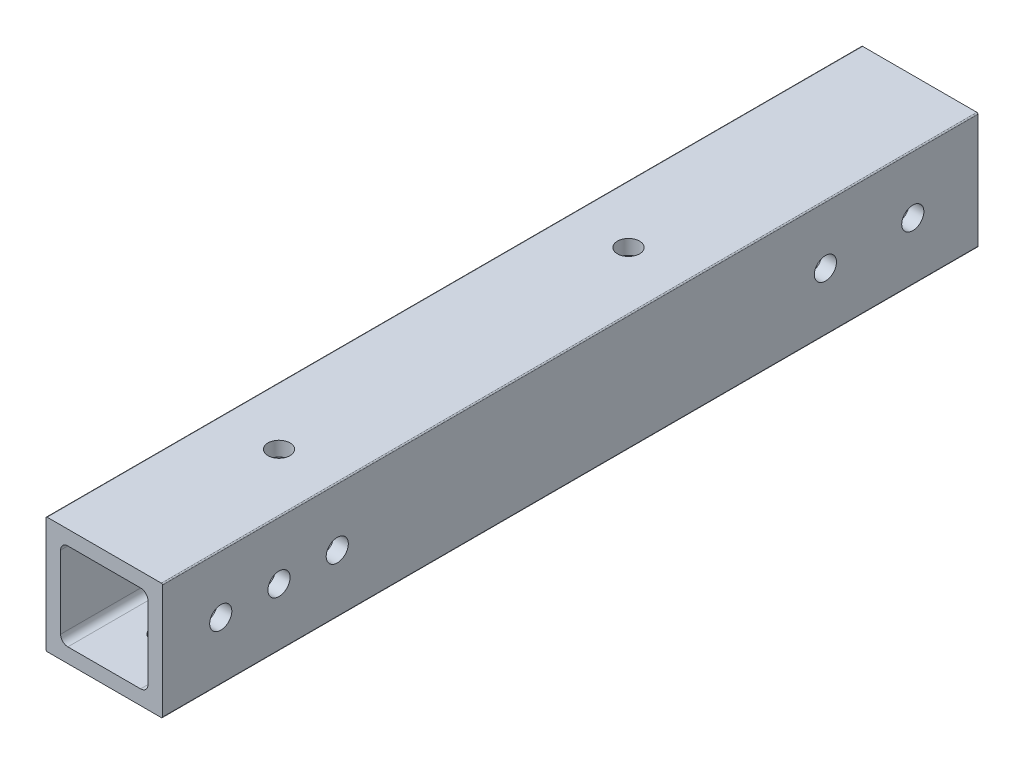
ISO-10303-21;
HEADER;
FILE_DESCRIPTION(('STEP AP214'),'2;1');
FILE_NAME('part.step','',(''),(''),'','','');
FILE_SCHEMA(('AUTOMOTIVE_DESIGN { 1 0 10303 214 1 1 1 1 }'));
ENDSEC;
DATA;
#1=APPLICATION_CONTEXT('core data for automotive mechanical design processes');
#2=APPLICATION_PROTOCOL_DEFINITION('international standard','automotive_design',2000,#1);
#3=PRODUCT_CONTEXT('',#1,'mechanical');
#4=PRODUCT('Part','Part','',(#3));
#5=PRODUCT_RELATED_PRODUCT_CATEGORY('part','',(#4));
#6=PRODUCT_DEFINITION_FORMATION('','',#4);
#7=PRODUCT_DEFINITION_CONTEXT('part definition',#1,'design');
#8=PRODUCT_DEFINITION('design','',#6,#7);
#9=PRODUCT_DEFINITION_SHAPE('','',#8);
#10=(LENGTH_UNIT() NAMED_UNIT(*) SI_UNIT(.MILLI.,.METRE.));
#11=(NAMED_UNIT(*) PLANE_ANGLE_UNIT() SI_UNIT($,.RADIAN.));
#12=(NAMED_UNIT(*) SI_UNIT($,.STERADIAN.) SOLID_ANGLE_UNIT());
#13=UNCERTAINTY_MEASURE_WITH_UNIT(LENGTH_MEASURE(1.E-05),#10,'distance_accuracy_value','');
#14=(GEOMETRIC_REPRESENTATION_CONTEXT(3) GLOBAL_UNCERTAINTY_ASSIGNED_CONTEXT((#13)) GLOBAL_UNIT_ASSIGNED_CONTEXT((#10,
#11,#12)) REPRESENTATION_CONTEXT('',''));
#15=CARTESIAN_POINT('',(0.,0.,0.));
#16=DIRECTION('',(0.,0.,1.));
#17=DIRECTION('',(1.,0.,0.));
#18=AXIS2_PLACEMENT_3D('',#15,#16,#17);
#19=CARTESIAN_POINT('',(3.175,4.7625,1828.8));
#20=DIRECTION('',(1.,0.,0.));
#21=DIRECTION('',(0.,1.,0.));
#22=AXIS2_PLACEMENT_3D('',#19,#20,#21);
#23=PLANE('',#22);
#24=CARTESIAN_POINT('',(3.175,12.7,1714.5));
#25=DIRECTION('',(1.,0.,0.));
#26=DIRECTION('',(0.,0.,-1.));
#27=AXIS2_PLACEMENT_3D('',#24,#25,#26);
#28=CIRCLE('',#27,2.4130000000001);
#29=CARTESIAN_POINT('',(3.175,12.7,1712.087));
#30=VERTEX_POINT('',#29);
#31=EDGE_CURVE('E390',#30,#30,#28,.T.);
#32=ORIENTED_EDGE('',*,*,#31,.F.);
#33=EDGE_LOOP('',(#32));
#34=FACE_BOUND('',#33,.T.);
#35=CARTESIAN_POINT('',(3.175,12.7,1790.7));
#36=DIRECTION('',(1.,0.,0.));
#37=DIRECTION('',(0.,0.,-1.));
#38=AXIS2_PLACEMENT_3D('',#35,#36,#37);
#39=CIRCLE('',#38,2.4130000000001);
#40=CARTESIAN_POINT('',(3.175,12.7,1788.287));
#41=VERTEX_POINT('',#40);
#42=EDGE_CURVE('E395',#41,#41,#39,.T.);
#43=ORIENTED_EDGE('',*,*,#42,.F.);
#44=EDGE_LOOP('',(#43));
#45=FACE_BOUND('',#44,.T.);
#46=DIRECTION('',(0.,-1.,0.));
#47=VECTOR('',#46,1.);
#48=CARTESIAN_POINT('',(3.175,4.7625,1651.));
#49=LINE('',#48,#47);
#50=CARTESIAN_POINT('',(3.175,20.6375,1651.));
#51=VERTEX_POINT('',#50);
#52=CARTESIAN_POINT('',(3.175,4.7625,1651.));
#53=VERTEX_POINT('',#52);
#54=EDGE_CURVE('E58',#51,#53,#49,.T.);
#55=ORIENTED_EDGE('',*,*,#54,.F.);
#56=DIRECTION('',(0.,0.,-1.));
#57=VECTOR('',#56,1.);
#58=CARTESIAN_POINT('',(3.175,20.6375,1828.8));
#59=LINE('',#58,#57);
#60=CARTESIAN_POINT('',(3.175,20.6375,1828.8));
#61=VERTEX_POINT('',#60);
#62=EDGE_CURVE('E51',#61,#51,#59,.T.);
#63=ORIENTED_EDGE('',*,*,#62,.F.);
#64=DIRECTION('',(0.,-1.,0.));
#65=VECTOR('',#64,1.);
#66=CARTESIAN_POINT('',(3.175,4.7625,1828.8));
#67=LINE('',#66,#65);
#68=CARTESIAN_POINT('',(3.175,4.7625,1828.8));
#69=VERTEX_POINT('',#68);
#70=EDGE_CURVE('E217',#61,#69,#67,.T.);
#71=ORIENTED_EDGE('',*,*,#70,.T.);
#72=DIRECTION('',(0.,0.,-1.));
#73=VECTOR('',#72,1.);
#74=CARTESIAN_POINT('',(3.175,4.7625,1828.8));
#75=LINE('',#74,#73);
#76=EDGE_CURVE('E322',#69,#53,#75,.T.);
#77=ORIENTED_EDGE('',*,*,#76,.T.);
#78=EDGE_LOOP('',(#55,#63,#71,#77));
#79=FACE_BOUND('',#78,.T.);
#80=ADVANCED_FACE('F43',(#34,#45,#79),#23,.T.);
#81=CARTESIAN_POINT('',(4.7625,20.6375,1828.8));
#82=DIRECTION('',(0.,0.,-1.));
#83=DIRECTION('',(-1.,0.,0.));
#84=AXIS2_PLACEMENT_3D('',#81,#82,#83);
#85=CYLINDRICAL_SURFACE('',#84,1.5875);
#86=ORIENTED_EDGE('',*,*,#62,.T.);
#87=CARTESIAN_POINT('',(4.7625,20.6375,1651.));
#88=DIRECTION('',(0.,0.,1.));
#89=DIRECTION('',(1.,0.,0.));
#90=AXIS2_PLACEMENT_3D('',#87,#88,#89);
#91=CIRCLE('',#90,1.5875);
#92=CARTESIAN_POINT('',(4.7625,22.225,1651.));
#93=VERTEX_POINT('',#92);
#94=EDGE_CURVE('E302',#51,#93,#91,.F.);
#95=ORIENTED_EDGE('',*,*,#94,.T.);
#96=DIRECTION('',(0.,0.,-1.));
#97=VECTOR('',#96,1.);
#98=CARTESIAN_POINT('',(4.7625,22.225,1828.8));
#99=LINE('',#98,#97);
#100=CARTESIAN_POINT('',(4.7625,22.225,1828.8));
#101=VERTEX_POINT('',#100);
#102=EDGE_CURVE('E290',#101,#93,#99,.T.);
#103=ORIENTED_EDGE('',*,*,#102,.F.);
#104=CARTESIAN_POINT('',(4.7625,20.6375,1828.8));
#105=DIRECTION('',(0.,0.,1.));
#106=DIRECTION('',(-1.,0.,0.));
#107=AXIS2_PLACEMENT_3D('',#104,#105,#106);
#108=CIRCLE('',#107,1.5875);
#109=EDGE_CURVE('E222',#101,#61,#108,.T.);
#110=ORIENTED_EDGE('',*,*,#109,.T.);
#111=EDGE_LOOP('',(#86,#95,#103,#110));
#112=FACE_BOUND('',#111,.T.);
#113=ADVANCED_FACE('F300',(#112),#85,.F.);
#114=CARTESIAN_POINT('',(4.7625,22.225,1828.8));
#115=DIRECTION('',(0.,-1.,0.));
#116=DIRECTION('',(0.,0.,-1.));
#117=AXIS2_PLACEMENT_3D('',#114,#115,#116);
#118=PLANE('',#117);
#119=CARTESIAN_POINT('',(12.7,22.225,1714.5));
#120=DIRECTION('',(0.,-1.,0.));
#121=DIRECTION('',(0.,0.,-1.));
#122=AXIS2_PLACEMENT_3D('',#119,#120,#121);
#123=CIRCLE('',#122,2.413);
#124=CARTESIAN_POINT('',(12.7,22.225,1712.087));
#125=VERTEX_POINT('',#124);
#126=EDGE_CURVE('E376',#125,#125,#123,.T.);
#127=ORIENTED_EDGE('',*,*,#126,.F.);
#128=EDGE_LOOP('',(#127));
#129=FACE_BOUND('',#128,.T.);
#130=CARTESIAN_POINT('',(12.7,22.225,1790.7));
#131=DIRECTION('',(0.,-1.,0.));
#132=DIRECTION('',(0.,0.,-1.));
#133=AXIS2_PLACEMENT_3D('',#130,#131,#132);
#134=CIRCLE('',#133,2.413);
#135=CARTESIAN_POINT('',(12.7,22.225,1788.287));
#136=VERTEX_POINT('',#135);
#137=EDGE_CURVE('E383',#136,#136,#134,.T.);
#138=ORIENTED_EDGE('',*,*,#137,.F.);
#139=EDGE_LOOP('',(#138));
#140=FACE_BOUND('',#139,.T.);
#141=DIRECTION('',(-1.,0.,0.));
#142=VECTOR('',#141,1.);
#143=CARTESIAN_POINT('',(4.7625,22.225,1651.));
#144=LINE('',#143,#142);
#145=CARTESIAN_POINT('',(20.6375,22.225,1651.));
#146=VERTEX_POINT('',#145);
#147=EDGE_CURVE('E335',#146,#93,#144,.T.);
#148=ORIENTED_EDGE('',*,*,#147,.F.);
#149=DIRECTION('',(0.,0.,-1.));
#150=VECTOR('',#149,1.);
#151=CARTESIAN_POINT('',(20.6375,22.225,1828.8));
#152=LINE('',#151,#150);
#153=CARTESIAN_POINT('',(20.6375,22.225,1828.8));
#154=VERTEX_POINT('',#153);
#155=EDGE_CURVE('E237',#154,#146,#152,.T.);
#156=ORIENTED_EDGE('',*,*,#155,.F.);
#157=DIRECTION('',(-1.,0.,0.));
#158=VECTOR('',#157,1.);
#159=CARTESIAN_POINT('',(4.7625,22.225,1828.8));
#160=LINE('',#159,#158);
#161=EDGE_CURVE('E226',#154,#101,#160,.T.);
#162=ORIENTED_EDGE('',*,*,#161,.T.);
#163=ORIENTED_EDGE('',*,*,#102,.T.);
#164=EDGE_LOOP('',(#148,#156,#162,#163));
#165=FACE_BOUND('',#164,.T.);
#166=ADVANCED_FACE('F289',(#129,#140,#165),#118,.T.);
#167=CARTESIAN_POINT('',(20.6375,20.6375,1828.8));
#168=DIRECTION('',(0.,0.,-1.));
#169=DIRECTION('',(-1.,0.,0.));
#170=AXIS2_PLACEMENT_3D('',#167,#168,#169);
#171=CYLINDRICAL_SURFACE('',#170,1.5875);
#172=ORIENTED_EDGE('',*,*,#155,.T.);
#173=CARTESIAN_POINT('',(20.6375,20.6375,1651.));
#174=DIRECTION('',(0.,0.,1.));
#175=DIRECTION('',(1.,0.,0.));
#176=AXIS2_PLACEMENT_3D('',#173,#174,#175);
#177=CIRCLE('',#176,1.5875);
#178=CARTESIAN_POINT('',(22.225,20.6375,1651.));
#179=VERTEX_POINT('',#178);
#180=EDGE_CURVE('E337',#146,#179,#177,.F.);
#181=ORIENTED_EDGE('',*,*,#180,.T.);
#182=DIRECTION('',(0.,0.,-1.));
#183=VECTOR('',#182,1.);
#184=CARTESIAN_POINT('',(22.225,20.6375,1828.8));
#185=LINE('',#184,#183);
#186=CARTESIAN_POINT('',(22.225,20.6375,1828.8));
#187=VERTEX_POINT('',#186);
#188=EDGE_CURVE('E233',#187,#179,#185,.T.);
#189=ORIENTED_EDGE('',*,*,#188,.F.);
#190=CARTESIAN_POINT('',(20.6375,20.6375,1828.8));
#191=DIRECTION('',(0.,0.,1.));
#192=DIRECTION('',(-1.,0.,0.));
#193=AXIS2_PLACEMENT_3D('',#190,#191,#192);
#194=CIRCLE('',#193,1.5875);
#195=EDGE_CURVE('E212',#187,#154,#194,.T.);
#196=ORIENTED_EDGE('',*,*,#195,.T.);
#197=EDGE_LOOP('',(#172,#181,#189,#196));
#198=FACE_BOUND('',#197,.T.);
#199=ADVANCED_FACE('F517',(#198),#171,.F.);
#200=CARTESIAN_POINT('',(22.225,4.7625,1828.8));
#201=DIRECTION('',(-1.,0.,0.));
#202=DIRECTION('',(0.,0.,1.));
#203=AXIS2_PLACEMENT_3D('',#200,#201,#202);
#204=PLANE('',#203);
#205=CARTESIAN_POINT('',(22.225,12.7,1790.7));
#206=DIRECTION('',(-1.,0.,0.));
#207=DIRECTION('',(0.,0.,1.));
#208=AXIS2_PLACEMENT_3D('',#205,#206,#207);
#209=CIRCLE('',#208,2.4130000000001);
#210=CARTESIAN_POINT('',(22.225,12.7,1793.113));
#211=VERTEX_POINT('',#210);
#212=EDGE_CURVE('E416',#211,#211,#209,.F.);
#213=ORIENTED_EDGE('',*,*,#212,.T.);
#214=EDGE_LOOP('',(#213));
#215=FACE_BOUND('',#214,.T.);
#216=CARTESIAN_POINT('',(22.225,12.7,1803.4));
#217=DIRECTION('',(-1.,0.,0.));
#218=DIRECTION('',(0.,0.,1.));
#219=AXIS2_PLACEMENT_3D('',#216,#217,#218);
#220=CIRCLE('',#219,2.4130000000001);
#221=CARTESIAN_POINT('',(22.225,12.7,1805.813));
#222=VERTEX_POINT('',#221);
#223=EDGE_CURVE('E408',#222,#222,#220,.F.);
#224=ORIENTED_EDGE('',*,*,#223,.T.);
#225=EDGE_LOOP('',(#224));
#226=FACE_BOUND('',#225,.T.);
#227=CARTESIAN_POINT('',(22.225,12.7,1816.1));
#228=DIRECTION('',(-1.,0.,0.));
#229=DIRECTION('',(0.,0.,1.));
#230=AXIS2_PLACEMENT_3D('',#227,#228,#229);
#231=CIRCLE('',#230,2.4130000000001);
#232=CARTESIAN_POINT('',(22.225,12.7,1818.513));
#233=VERTEX_POINT('',#232);
#234=EDGE_CURVE('E409',#233,#233,#231,.F.);
#235=ORIENTED_EDGE('',*,*,#234,.T.);
#236=EDGE_LOOP('',(#235));
#237=FACE_BOUND('',#236,.T.);
#238=CARTESIAN_POINT('',(22.225,12.7000000000002,1665.21621166384));
#239=DIRECTION('',(-1.,0.,0.));
#240=DIRECTION('',(0.,0.,1.));
#241=AXIS2_PLACEMENT_3D('',#238,#239,#240);
#242=CIRCLE('',#241,2.41299999999989);
#243=CARTESIAN_POINT('',(22.225,12.7000000000002,1667.62921166384));
#244=VERTEX_POINT('',#243);
#245=EDGE_CURVE('E360',#244,#244,#242,.F.);
#246=ORIENTED_EDGE('',*,*,#245,.T.);
#247=EDGE_LOOP('',(#246));
#248=FACE_BOUND('',#247,.T.);
#249=CARTESIAN_POINT('',(22.225,12.7,1684.26621166384));
#250=DIRECTION('',(-1.,0.,0.));
#251=DIRECTION('',(0.,0.,1.));
#252=AXIS2_PLACEMENT_3D('',#249,#250,#251);
#253=CIRCLE('',#252,2.4130000000001);
#254=CARTESIAN_POINT('',(22.225,12.7,1686.67921166384));
#255=VERTEX_POINT('',#254);
#256=EDGE_CURVE('E361',#255,#255,#253,.F.);
#257=ORIENTED_EDGE('',*,*,#256,.T.);
#258=EDGE_LOOP('',(#257));
#259=FACE_BOUND('',#258,.T.);
#260=DIRECTION('',(0.,1.,0.));
#261=VECTOR('',#260,1.);
#262=CARTESIAN_POINT('',(22.225,4.7625,1651.));
#263=LINE('',#262,#261);
#264=CARTESIAN_POINT('',(22.225,4.7625,1651.));
#265=VERTEX_POINT('',#264);
#266=EDGE_CURVE('E340',#265,#179,#263,.T.);
#267=ORIENTED_EDGE('',*,*,#266,.F.);
#268=DIRECTION('',(0.,0.,-1.));
#269=VECTOR('',#268,1.);
#270=CARTESIAN_POINT('',(22.225,4.7625,1828.8));
#271=LINE('',#270,#269);
#272=CARTESIAN_POINT('',(22.225,4.7625,1828.8));
#273=VERTEX_POINT('',#272);
#274=EDGE_CURVE('E238',#273,#265,#271,.T.);
#275=ORIENTED_EDGE('',*,*,#274,.F.);
#276=DIRECTION('',(0.,1.,0.));
#277=VECTOR('',#276,1.);
#278=CARTESIAN_POINT('',(22.225,4.7625,1828.8));
#279=LINE('',#278,#277);
#280=EDGE_CURVE('E208',#273,#187,#279,.T.);
#281=ORIENTED_EDGE('',*,*,#280,.T.);
#282=ORIENTED_EDGE('',*,*,#188,.T.);
#283=EDGE_LOOP('',(#267,#275,#281,#282));
#284=FACE_BOUND('',#283,.T.);
#285=ADVANCED_FACE('F497',(#215,#226,#237,#248,#259,#284),#204,.T.);
#286=CARTESIAN_POINT('',(20.6375,4.7625,1828.8));
#287=DIRECTION('',(0.,0.,-1.));
#288=DIRECTION('',(-1.,0.,0.));
#289=AXIS2_PLACEMENT_3D('',#286,#287,#288);
#290=CYLINDRICAL_SURFACE('',#289,1.5875);
#291=ORIENTED_EDGE('',*,*,#274,.T.);
#292=CARTESIAN_POINT('',(20.6375,4.7625,1651.));
#293=DIRECTION('',(0.,0.,1.));
#294=DIRECTION('',(1.,0.,0.));
#295=AXIS2_PLACEMENT_3D('',#292,#293,#294);
#296=CIRCLE('',#295,1.5875);
#297=CARTESIAN_POINT('',(20.6375,3.175,1651.));
#298=VERTEX_POINT('',#297);
#299=EDGE_CURVE('E342',#265,#298,#296,.F.);
#300=ORIENTED_EDGE('',*,*,#299,.T.);
#301=DIRECTION('',(0.,0.,-1.));
#302=VECTOR('',#301,1.);
#303=CARTESIAN_POINT('',(20.6375,3.175,1828.8));
#304=LINE('',#303,#302);
#305=CARTESIAN_POINT('',(20.6375,3.175,1828.8));
#306=VERTEX_POINT('',#305);
#307=EDGE_CURVE('E264',#306,#298,#304,.T.);
#308=ORIENTED_EDGE('',*,*,#307,.F.);
#309=CARTESIAN_POINT('',(20.6375,4.7625,1828.8));
#310=DIRECTION('',(0.,0.,1.));
#311=DIRECTION('',(-1.,0.,0.));
#312=AXIS2_PLACEMENT_3D('',#309,#310,#311);
#313=CIRCLE('',#312,1.5875);
#314=EDGE_CURVE('E211',#306,#273,#313,.T.);
#315=ORIENTED_EDGE('',*,*,#314,.T.);
#316=EDGE_LOOP('',(#291,#300,#308,#315));
#317=FACE_BOUND('',#316,.T.);
#318=ADVANCED_FACE('F495',(#317),#290,.F.);
#319=CARTESIAN_POINT('',(4.7625,3.175,1828.8));
#320=DIRECTION('',(0.,1.,0.));
#321=DIRECTION('',(1.,0.,0.));
#322=AXIS2_PLACEMENT_3D('',#319,#320,#321);
#323=PLANE('',#322);
#324=CARTESIAN_POINT('',(12.7,3.175,1816.1));
#325=DIRECTION('',(0.,1.,0.));
#326=DIRECTION('',(0.,0.,1.));
#327=AXIS2_PLACEMENT_3D('',#324,#325,#326);
#328=CIRCLE('',#327,2.413);
#329=CARTESIAN_POINT('',(12.7,3.175,1818.513));
#330=VERTEX_POINT('',#329);
#331=EDGE_CURVE('E433',#330,#330,#328,.F.);
#332=ORIENTED_EDGE('',*,*,#331,.T.);
#333=EDGE_LOOP('',(#332));
#334=FACE_BOUND('',#333,.T.);
#335=CARTESIAN_POINT('',(12.7,3.175,1803.4));
#336=DIRECTION('',(0.,1.,0.));
#337=DIRECTION('',(0.,0.,1.));
#338=AXIS2_PLACEMENT_3D('',#335,#336,#337);
#339=CIRCLE('',#338,2.413);
#340=CARTESIAN_POINT('',(12.7,3.175,1805.813));
#341=VERTEX_POINT('',#340);
#342=EDGE_CURVE('E429',#341,#341,#339,.F.);
#343=ORIENTED_EDGE('',*,*,#342,.T.);
#344=EDGE_LOOP('',(#343));
#345=FACE_BOUND('',#344,.T.);
#346=CARTESIAN_POINT('',(12.7,3.175,1790.7));
#347=DIRECTION('',(0.,1.,0.));
#348=DIRECTION('',(0.,0.,1.));
#349=AXIS2_PLACEMENT_3D('',#346,#347,#348);
#350=CIRCLE('',#349,2.413);
#351=CARTESIAN_POINT('',(12.7,3.175,1793.113));
#352=VERTEX_POINT('',#351);
#353=EDGE_CURVE('E423',#352,#352,#350,.F.);
#354=ORIENTED_EDGE('',*,*,#353,.T.);
#355=EDGE_LOOP('',(#354));
#356=FACE_BOUND('',#355,.T.);
#357=CARTESIAN_POINT('',(12.7,3.175,1684.02));
#358=DIRECTION('',(0.,1.,0.));
#359=DIRECTION('',(0.,0.,1.));
#360=AXIS2_PLACEMENT_3D('',#357,#358,#359);
#361=CIRCLE('',#360,2.41300000000001);
#362=CARTESIAN_POINT('',(12.7,3.175,1686.433));
#363=VERTEX_POINT('',#362);
#364=EDGE_CURVE('E372',#363,#363,#361,.F.);
#365=ORIENTED_EDGE('',*,*,#364,.T.);
#366=EDGE_LOOP('',(#365));
#367=FACE_BOUND('',#366,.T.);
#368=CARTESIAN_POINT('',(12.7,3.175,1664.97));
#369=DIRECTION('',(0.,1.,0.));
#370=DIRECTION('',(0.,0.,1.));
#371=AXIS2_PLACEMENT_3D('',#368,#369,#370);
#372=CIRCLE('',#371,2.413);
#373=CARTESIAN_POINT('',(12.7,3.175,1667.383));
#374=VERTEX_POINT('',#373);
#375=EDGE_CURVE('E373',#374,#374,#372,.F.);
#376=ORIENTED_EDGE('',*,*,#375,.T.);
#377=EDGE_LOOP('',(#376));
#378=FACE_BOUND('',#377,.T.);
#379=DIRECTION('',(1.,0.,0.));
#380=VECTOR('',#379,1.);
#381=CARTESIAN_POINT('',(4.7625,3.175,1651.));
#382=LINE('',#381,#380);
#383=CARTESIAN_POINT('',(4.7625,3.175,1651.));
#384=VERTEX_POINT('',#383);
#385=EDGE_CURVE('E345',#384,#298,#382,.T.);
#386=ORIENTED_EDGE('',*,*,#385,.F.);
#387=DIRECTION('',(0.,0.,-1.));
#388=VECTOR('',#387,1.);
#389=CARTESIAN_POINT('',(4.7625,3.175,1828.8));
#390=LINE('',#389,#388);
#391=CARTESIAN_POINT('',(4.7625,3.175,1828.8));
#392=VERTEX_POINT('',#391);
#393=EDGE_CURVE('E268',#392,#384,#390,.T.);
#394=ORIENTED_EDGE('',*,*,#393,.F.);
#395=DIRECTION('',(1.,0.,0.));
#396=VECTOR('',#395,1.);
#397=CARTESIAN_POINT('',(4.7625,3.175,1828.8));
#398=LINE('',#397,#396);
#399=EDGE_CURVE('E254',#392,#306,#398,.T.);
#400=ORIENTED_EDGE('',*,*,#399,.T.);
#401=ORIENTED_EDGE('',*,*,#307,.T.);
#402=EDGE_LOOP('',(#386,#394,#400,#401));
#403=FACE_BOUND('',#402,.T.);
#404=ADVANCED_FACE('F441',(#334,#345,#356,#367,#378,#403),#323,.T.);
#405=CARTESIAN_POINT('',(4.7625,4.7625,1828.8));
#406=DIRECTION('',(0.,0.,-1.));
#407=DIRECTION('',(-1.,0.,0.));
#408=AXIS2_PLACEMENT_3D('',#405,#406,#407);
#409=CYLINDRICAL_SURFACE('',#408,1.5875);
#410=ORIENTED_EDGE('',*,*,#393,.T.);
#411=CARTESIAN_POINT('',(4.7625,4.7625,1651.));
#412=DIRECTION('',(0.,0.,1.));
#413=DIRECTION('',(1.,0.,0.));
#414=AXIS2_PLACEMENT_3D('',#411,#412,#413);
#415=CIRCLE('',#414,1.5875);
#416=EDGE_CURVE('E347',#384,#53,#415,.F.);
#417=ORIENTED_EDGE('',*,*,#416,.T.);
#418=ORIENTED_EDGE('',*,*,#76,.F.);
#419=CARTESIAN_POINT('',(4.7625,4.7625,1828.8));
#420=DIRECTION('',(0.,0.,1.));
#421=DIRECTION('',(1.,0.,0.));
#422=AXIS2_PLACEMENT_3D('',#419,#420,#421);
#423=CIRCLE('',#422,1.5875);
#424=EDGE_CURVE('E213',#69,#392,#423,.T.);
#425=ORIENTED_EDGE('',*,*,#424,.T.);
#426=EDGE_LOOP('',(#410,#417,#418,#425));
#427=FACE_BOUND('',#426,.T.);
#428=ADVANCED_FACE('F514',(#427),#409,.F.);
#429=CARTESIAN_POINT('',(0.,0.254,1828.8));
#430=DIRECTION('',(1.,0.,0.));
#431=DIRECTION('',(0.,1.,0.));
#432=AXIS2_PLACEMENT_3D('',#429,#430,#431);
#433=PLANE('',#432);
#434=CARTESIAN_POINT('',(0.,12.7,1714.5));
#435=DIRECTION('',(-1.,0.,0.));
#436=DIRECTION('',(0.,0.,1.));
#437=AXIS2_PLACEMENT_3D('',#434,#435,#436);
#438=CIRCLE('',#437,2.4130000000001);
#439=CARTESIAN_POINT('',(0.,12.7,1716.913));
#440=VERTEX_POINT('',#439);
#441=EDGE_CURVE('E398',#440,#440,#438,.T.);
#442=ORIENTED_EDGE('',*,*,#441,.F.);
#443=EDGE_LOOP('',(#442));
#444=FACE_BOUND('',#443,.T.);
#445=CARTESIAN_POINT('',(0.,12.7,1790.7));
#446=DIRECTION('',(-1.,0.,0.));
#447=DIRECTION('',(0.,0.,1.));
#448=AXIS2_PLACEMENT_3D('',#445,#446,#447);
#449=CIRCLE('',#448,2.4130000000001);
#450=CARTESIAN_POINT('',(0.,12.7,1793.113));
#451=VERTEX_POINT('',#450);
#452=EDGE_CURVE('E399',#451,#451,#449,.T.);
#453=ORIENTED_EDGE('',*,*,#452,.F.);
#454=EDGE_LOOP('',(#453));
#455=FACE_BOUND('',#454,.T.);
#456=DIRECTION('',(0.,0.,-1.));
#457=VECTOR('',#456,1.);
#458=CARTESIAN_POINT('',(0.,25.146,1828.8));
#459=LINE('',#458,#457);
#460=CARTESIAN_POINT('',(0.,25.146,1828.8));
#461=VERTEX_POINT('',#460);
#462=CARTESIAN_POINT('',(0.,25.146,1651.));
#463=VERTEX_POINT('',#462);
#464=EDGE_CURVE('E263',#461,#463,#459,.T.);
#465=ORIENTED_EDGE('',*,*,#464,.T.);
#466=DIRECTION('',(0.,-1.,0.));
#467=VECTOR('',#466,1.);
#468=CARTESIAN_POINT('',(0.,0.254,1651.));
#469=LINE('',#468,#467);
#470=CARTESIAN_POINT('',(0.,0.254,1651.));
#471=VERTEX_POINT('',#470);
#472=EDGE_CURVE('E185',#463,#471,#469,.T.);
#473=ORIENTED_EDGE('',*,*,#472,.T.);
#474=DIRECTION('',(0.,0.,-1.));
#475=VECTOR('',#474,1.);
#476=CARTESIAN_POINT('',(0.,0.254,1828.8));
#477=LINE('',#476,#475);
#478=CARTESIAN_POINT('',(0.,0.254,1828.8));
#479=VERTEX_POINT('',#478);
#480=EDGE_CURVE('E194',#479,#471,#477,.T.);
#481=ORIENTED_EDGE('',*,*,#480,.F.);
#482=DIRECTION('',(0.,-1.,0.));
#483=VECTOR('',#482,1.);
#484=CARTESIAN_POINT('',(0.,0.254,1828.8));
#485=LINE('',#484,#483);
#486=EDGE_CURVE('E218',#461,#479,#485,.T.);
#487=ORIENTED_EDGE('',*,*,#486,.F.);
#488=EDGE_LOOP('',(#465,#473,#481,#487));
#489=FACE_BOUND('',#488,.T.);
#490=ADVANCED_FACE('F510',(#444,#455,#489),#433,.F.);
#491=CARTESIAN_POINT('',(0.254,25.146,1828.8));
#492=DIRECTION('',(0.,0.,-1.));
#493=DIRECTION('',(-1.,0.,0.));
#494=AXIS2_PLACEMENT_3D('',#491,#492,#493);
#495=CYLINDRICAL_SURFACE('',#494,0.254);
#496=CARTESIAN_POINT('',(0.254,25.146,1651.));
#497=DIRECTION('',(0.,0.,1.));
#498=DIRECTION('',(1.,0.,0.));
#499=AXIS2_PLACEMENT_3D('',#496,#497,#498);
#500=CIRCLE('',#499,0.254);
#501=CARTESIAN_POINT('',(0.254000000000004,25.4,1651.));
#502=VERTEX_POINT('',#501);
#503=EDGE_CURVE('E176',#463,#502,#500,.F.);
#504=ORIENTED_EDGE('',*,*,#503,.F.);
#505=ORIENTED_EDGE('',*,*,#464,.F.);
#506=CARTESIAN_POINT('',(0.254,25.146,1828.8));
#507=DIRECTION('',(0.,0.,1.));
#508=DIRECTION('',(-1.,0.,0.));
#509=AXIS2_PLACEMENT_3D('',#506,#507,#508);
#510=CIRCLE('',#509,0.254);
#511=CARTESIAN_POINT('',(0.254,25.4,1828.8));
#512=VERTEX_POINT('',#511);
#513=EDGE_CURVE('E239',#512,#461,#510,.T.);
#514=ORIENTED_EDGE('',*,*,#513,.F.);
#515=DIRECTION('',(0.,0.,-1.));
#516=VECTOR('',#515,1.);
#517=CARTESIAN_POINT('',(0.254,25.4,1828.8));
#518=LINE('',#517,#516);
#519=EDGE_CURVE('E259',#512,#502,#518,.T.);
#520=ORIENTED_EDGE('',*,*,#519,.T.);
#521=EDGE_LOOP('',(#504,#505,#514,#520));
#522=FACE_BOUND('',#521,.T.);
#523=ADVANCED_FACE('F506',(#522),#495,.T.);
#524=CARTESIAN_POINT('',(0.254,25.4,1828.8));
#525=DIRECTION('',(0.,-1.,0.));
#526=DIRECTION('',(0.,0.,-1.));
#527=AXIS2_PLACEMENT_3D('',#524,#525,#526);
#528=PLANE('',#527);
#529=CARTESIAN_POINT('',(12.7,25.4,1714.5));
#530=DIRECTION('',(0.,1.,0.));
#531=DIRECTION('',(0.,0.,1.));
#532=AXIS2_PLACEMENT_3D('',#529,#530,#531);
#533=CIRCLE('',#532,2.413);
#534=CARTESIAN_POINT('',(12.7,25.4,1716.913));
#535=VERTEX_POINT('',#534);
#536=EDGE_CURVE('E386',#535,#535,#533,.T.);
#537=ORIENTED_EDGE('',*,*,#536,.F.);
#538=EDGE_LOOP('',(#537));
#539=FACE_BOUND('',#538,.T.);
#540=CARTESIAN_POINT('',(12.7,25.4,1790.7));
#541=DIRECTION('',(0.,1.,0.));
#542=DIRECTION('',(0.,0.,1.));
#543=AXIS2_PLACEMENT_3D('',#540,#541,#542);
#544=CIRCLE('',#543,2.413);
#545=CARTESIAN_POINT('',(12.7,25.4,1793.113));
#546=VERTEX_POINT('',#545);
#547=EDGE_CURVE('E387',#546,#546,#544,.T.);
#548=ORIENTED_EDGE('',*,*,#547,.F.);
#549=EDGE_LOOP('',(#548));
#550=FACE_BOUND('',#549,.T.);
#551=DIRECTION('',(0.,0.,-1.));
#552=VECTOR('',#551,1.);
#553=CARTESIAN_POINT('',(25.146,25.4,1828.8));
#554=LINE('',#553,#552);
#555=CARTESIAN_POINT('',(25.146,25.4,1828.8));
#556=VERTEX_POINT('',#555);
#557=CARTESIAN_POINT('',(25.146,25.4,1651.));
#558=VERTEX_POINT('',#557);
#559=EDGE_CURVE('E255',#556,#558,#554,.T.);
#560=ORIENTED_EDGE('',*,*,#559,.T.);
#561=DIRECTION('',(1.,0.,0.));
#562=VECTOR('',#561,1.);
#563=CARTESIAN_POINT('',(-135.222379220066,25.4,1651.));
#564=LINE('',#563,#562);
#565=EDGE_CURVE('E186',#502,#558,#564,.T.);
#566=ORIENTED_EDGE('',*,*,#565,.F.);
#567=ORIENTED_EDGE('',*,*,#519,.F.);
#568=DIRECTION('',(-1.,0.,0.));
#569=VECTOR('',#568,1.);
#570=CARTESIAN_POINT('',(0.254,25.4,1828.8));
#571=LINE('',#570,#569);
#572=EDGE_CURVE('E231',#556,#512,#571,.T.);
#573=ORIENTED_EDGE('',*,*,#572,.F.);
#574=EDGE_LOOP('',(#560,#566,#567,#573));
#575=FACE_BOUND('',#574,.T.);
#576=ADVANCED_FACE('F509',(#539,#550,#575),#528,.F.);
#577=CARTESIAN_POINT('',(25.146,25.146,1828.8));
#578=DIRECTION('',(0.,0.,-1.));
#579=DIRECTION('',(-1.,0.,0.));
#580=AXIS2_PLACEMENT_3D('',#577,#578,#579);
#581=CYLINDRICAL_SURFACE('',#580,0.254);
#582=CARTESIAN_POINT('',(25.146,25.146,1651.));
#583=DIRECTION('',(0.,0.,1.));
#584=DIRECTION('',(1.,0.,0.));
#585=AXIS2_PLACEMENT_3D('',#582,#583,#584);
#586=CIRCLE('',#585,0.254);
#587=CARTESIAN_POINT('',(25.4,25.146,1651.));
#588=VERTEX_POINT('',#587);
#589=EDGE_CURVE('E349',#558,#588,#586,.F.);
#590=ORIENTED_EDGE('',*,*,#589,.F.);
#591=ORIENTED_EDGE('',*,*,#559,.F.);
#592=CARTESIAN_POINT('',(25.146,25.146,1828.8));
#593=DIRECTION('',(0.,0.,1.));
#594=DIRECTION('',(-1.,0.,0.));
#595=AXIS2_PLACEMENT_3D('',#592,#593,#594);
#596=CIRCLE('',#595,0.254);
#597=CARTESIAN_POINT('',(25.4,25.146,1828.8));
#598=VERTEX_POINT('',#597);
#599=EDGE_CURVE('E227',#598,#556,#596,.T.);
#600=ORIENTED_EDGE('',*,*,#599,.F.);
#601=DIRECTION('',(0.,0.,-1.));
#602=VECTOR('',#601,1.);
#603=CARTESIAN_POINT('',(25.4,25.146,1828.8));
#604=LINE('',#603,#602);
#605=EDGE_CURVE('E200',#598,#588,#604,.T.);
#606=ORIENTED_EDGE('',*,*,#605,.T.);
#607=EDGE_LOOP('',(#590,#591,#600,#606));
#608=FACE_BOUND('',#607,.T.);
#609=ADVANCED_FACE('F45',(#608),#581,.T.);
#610=CARTESIAN_POINT('',(25.4,0.254,1828.8));
#611=DIRECTION('',(-1.,0.,0.));
#612=DIRECTION('',(0.,0.,1.));
#613=AXIS2_PLACEMENT_3D('',#610,#611,#612);
#614=PLANE('',#613);
#615=CARTESIAN_POINT('',(25.4,12.7,1790.7));
#616=DIRECTION('',(1.,0.,0.));
#617=DIRECTION('',(0.,0.,-1.));
#618=AXIS2_PLACEMENT_3D('',#615,#616,#617);
#619=CIRCLE('',#618,2.4130000000001);
#620=CARTESIAN_POINT('',(25.4,12.7,1788.287));
#621=VERTEX_POINT('',#620);
#622=EDGE_CURVE('E402',#621,#621,#619,.T.);
#623=ORIENTED_EDGE('',*,*,#622,.F.);
#624=EDGE_LOOP('',(#623));
#625=FACE_BOUND('',#624,.T.);
#626=CARTESIAN_POINT('',(25.4,12.7,1803.4));
#627=DIRECTION('',(1.,0.,0.));
#628=DIRECTION('',(0.,0.,-1.));
#629=AXIS2_PLACEMENT_3D('',#626,#627,#628);
#630=CIRCLE('',#629,2.4130000000001);
#631=CARTESIAN_POINT('',(25.4,12.7,1800.987));
#632=VERTEX_POINT('',#631);
#633=EDGE_CURVE('E413',#632,#632,#630,.T.);
#634=ORIENTED_EDGE('',*,*,#633,.F.);
#635=EDGE_LOOP('',(#634));
#636=FACE_BOUND('',#635,.T.);
#637=CARTESIAN_POINT('',(25.4,12.7,1816.1));
#638=DIRECTION('',(1.,0.,0.));
#639=DIRECTION('',(0.,0.,-1.));
#640=AXIS2_PLACEMENT_3D('',#637,#638,#639);
#641=CIRCLE('',#640,2.4130000000001);
#642=CARTESIAN_POINT('',(25.4,12.7,1813.687));
#643=VERTEX_POINT('',#642);
#644=EDGE_CURVE('E405',#643,#643,#641,.T.);
#645=ORIENTED_EDGE('',*,*,#644,.F.);
#646=EDGE_LOOP('',(#645));
#647=FACE_BOUND('',#646,.T.);
#648=CARTESIAN_POINT('',(25.4,12.7000000000002,1665.21621166384));
#649=DIRECTION('',(1.,0.,0.));
#650=DIRECTION('',(0.,0.,-1.));
#651=AXIS2_PLACEMENT_3D('',#648,#649,#650);
#652=CIRCLE('',#651,2.41299999999989);
#653=CARTESIAN_POINT('',(25.4,12.7000000000002,1662.80321166384));
#654=VERTEX_POINT('',#653);
#655=EDGE_CURVE('E356',#654,#654,#652,.T.);
#656=ORIENTED_EDGE('',*,*,#655,.F.);
#657=EDGE_LOOP('',(#656));
#658=FACE_BOUND('',#657,.T.);
#659=CARTESIAN_POINT('',(25.4,12.7,1684.26621166384));
#660=DIRECTION('',(1.,0.,0.));
#661=DIRECTION('',(0.,0.,-1.));
#662=AXIS2_PLACEMENT_3D('',#659,#660,#661);
#663=CIRCLE('',#662,2.4130000000001);
#664=CARTESIAN_POINT('',(25.4,12.7,1681.85321166384));
#665=VERTEX_POINT('',#664);
#666=EDGE_CURVE('E357',#665,#665,#663,.T.);
#667=ORIENTED_EDGE('',*,*,#666,.F.);
#668=EDGE_LOOP('',(#667));
#669=FACE_BOUND('',#668,.T.);
#670=DIRECTION('',(0.,0.,-1.));
#671=VECTOR('',#670,1.);
#672=CARTESIAN_POINT('',(25.4,0.254,1828.8));
#673=LINE('',#672,#671);
#674=CARTESIAN_POINT('',(25.4,0.254,1828.8));
#675=VERTEX_POINT('',#674);
#676=CARTESIAN_POINT('',(25.4,0.254,1651.));
#677=VERTEX_POINT('',#676);
#678=EDGE_CURVE('E193',#675,#677,#673,.T.);
#679=ORIENTED_EDGE('',*,*,#678,.T.);
#680=DIRECTION('',(0.,1.,0.));
#681=VECTOR('',#680,1.);
#682=CARTESIAN_POINT('',(25.4,0.254,1651.));
#683=LINE('',#682,#681);
#684=EDGE_CURVE('E172',#677,#588,#683,.T.);
#685=ORIENTED_EDGE('',*,*,#684,.T.);
#686=ORIENTED_EDGE('',*,*,#605,.F.);
#687=DIRECTION('',(0.,1.,0.));
#688=VECTOR('',#687,1.);
#689=CARTESIAN_POINT('',(25.4,0.254,1828.8));
#690=LINE('',#689,#688);
#691=EDGE_CURVE('E232',#675,#598,#690,.T.);
#692=ORIENTED_EDGE('',*,*,#691,.F.);
#693=EDGE_LOOP('',(#679,#685,#686,#692));
#694=FACE_BOUND('',#693,.T.);
#695=ADVANCED_FACE('F500',(#625,#636,#647,#658,#669,#694),#614,.F.);
#696=CARTESIAN_POINT('',(25.146,0.254,1828.8));
#697=DIRECTION('',(0.,0.,-1.));
#698=DIRECTION('',(-1.,0.,0.));
#699=AXIS2_PLACEMENT_3D('',#696,#697,#698);
#700=CYLINDRICAL_SURFACE('',#699,0.254);
#701=CARTESIAN_POINT('',(25.146,0.254,1651.));
#702=DIRECTION('',(0.,0.,1.));
#703=DIRECTION('',(1.,0.,0.));
#704=AXIS2_PLACEMENT_3D('',#701,#702,#703);
#705=CIRCLE('',#704,0.254);
#706=CARTESIAN_POINT('',(25.146,0.,1651.));
#707=VERTEX_POINT('',#706);
#708=EDGE_CURVE('E169',#677,#707,#705,.F.);
#709=ORIENTED_EDGE('',*,*,#708,.F.);
#710=ORIENTED_EDGE('',*,*,#678,.F.);
#711=CARTESIAN_POINT('',(25.146,0.254,1828.8));
#712=DIRECTION('',(0.,0.,1.));
#713=DIRECTION('',(1.,0.,0.));
#714=AXIS2_PLACEMENT_3D('',#711,#712,#713);
#715=CIRCLE('',#714,0.254);
#716=CARTESIAN_POINT('',(25.146,0.,1828.8));
#717=VERTEX_POINT('',#716);
#718=EDGE_CURVE('E190',#717,#675,#715,.T.);
#719=ORIENTED_EDGE('',*,*,#718,.F.);
#720=DIRECTION('',(0.,0.,-1.));
#721=VECTOR('',#720,1.);
#722=CARTESIAN_POINT('',(25.146,0.,1828.8));
#723=LINE('',#722,#721);
#724=EDGE_CURVE('E182',#717,#707,#723,.T.);
#725=ORIENTED_EDGE('',*,*,#724,.T.);
#726=EDGE_LOOP('',(#709,#710,#719,#725));
#727=FACE_BOUND('',#726,.T.);
#728=ADVANCED_FACE('F188',(#727),#700,.T.);
#729=CARTESIAN_POINT('',(0.254,0.,1828.8));
#730=DIRECTION('',(0.,1.,0.));
#731=DIRECTION('',(1.,0.,0.));
#732=AXIS2_PLACEMENT_3D('',#729,#730,#731);
#733=PLANE('',#732);
#734=CARTESIAN_POINT('',(12.7,0.,1816.1));
#735=DIRECTION('',(0.,-1.,0.));
#736=DIRECTION('',(0.,0.,-1.));
#737=AXIS2_PLACEMENT_3D('',#734,#735,#736);
#738=CIRCLE('',#737,2.413);
#739=CARTESIAN_POINT('',(12.7,0.,1813.687));
#740=VERTEX_POINT('',#739);
#741=EDGE_CURVE('E412',#740,#740,#738,.T.);
#742=ORIENTED_EDGE('',*,*,#741,.F.);
#743=EDGE_LOOP('',(#742));
#744=FACE_BOUND('',#743,.T.);
#745=CARTESIAN_POINT('',(12.7,0.,1803.4));
#746=DIRECTION('',(0.,-1.,0.));
#747=DIRECTION('',(0.,0.,-1.));
#748=AXIS2_PLACEMENT_3D('',#745,#746,#747);
#749=CIRCLE('',#748,2.413);
#750=CARTESIAN_POINT('',(12.7,0.,1800.987));
#751=VERTEX_POINT('',#750);
#752=EDGE_CURVE('E430',#751,#751,#749,.T.);
#753=ORIENTED_EDGE('',*,*,#752,.F.);
#754=EDGE_LOOP('',(#753));
#755=FACE_BOUND('',#754,.T.);
#756=CARTESIAN_POINT('',(12.7,0.,1790.7));
#757=DIRECTION('',(0.,-1.,0.));
#758=DIRECTION('',(0.,0.,-1.));
#759=AXIS2_PLACEMENT_3D('',#756,#757,#758);
#760=CIRCLE('',#759,2.413);
#761=CARTESIAN_POINT('',(12.7,0.,1788.287));
#762=VERTEX_POINT('',#761);
#763=EDGE_CURVE('E426',#762,#762,#760,.T.);
#764=ORIENTED_EDGE('',*,*,#763,.F.);
#765=EDGE_LOOP('',(#764));
#766=FACE_BOUND('',#765,.T.);
#767=CARTESIAN_POINT('',(12.7,0.,1684.02));
#768=DIRECTION('',(0.,-1.,0.));
#769=DIRECTION('',(0.,0.,1.));
#770=AXIS2_PLACEMENT_3D('',#767,#768,#769);
#771=CIRCLE('',#770,2.41300000000001);
#772=CARTESIAN_POINT('',(12.7,0.,1686.433));
#773=VERTEX_POINT('',#772);
#774=EDGE_CURVE('E364',#773,#773,#771,.T.);
#775=ORIENTED_EDGE('',*,*,#774,.F.);
#776=EDGE_LOOP('',(#775));
#777=FACE_BOUND('',#776,.T.);
#778=CARTESIAN_POINT('',(12.7,0.,1664.97));
#779=DIRECTION('',(0.,-1.,0.));
#780=DIRECTION('',(0.,0.,1.));
#781=AXIS2_PLACEMENT_3D('',#778,#779,#780);
#782=CIRCLE('',#781,2.413);
#783=CARTESIAN_POINT('',(12.7,0.,1667.383));
#784=VERTEX_POINT('',#783);
#785=EDGE_CURVE('E369',#784,#784,#782,.T.);
#786=ORIENTED_EDGE('',*,*,#785,.F.);
#787=EDGE_LOOP('',(#786));
#788=FACE_BOUND('',#787,.T.);
#789=DIRECTION('',(0.,0.,-1.));
#790=VECTOR('',#789,1.);
#791=CARTESIAN_POINT('',(0.254,0.,1828.8));
#792=LINE('',#791,#790);
#793=CARTESIAN_POINT('',(0.254,0.,1828.8));
#794=VERTEX_POINT('',#793);
#795=CARTESIAN_POINT('',(0.254,0.,1651.));
#796=VERTEX_POINT('',#795);
#797=EDGE_CURVE('E184',#794,#796,#792,.T.);
#798=ORIENTED_EDGE('',*,*,#797,.T.);
#799=DIRECTION('',(-1.,0.,0.));
#800=VECTOR('',#799,1.);
#801=CARTESIAN_POINT('',(-135.222379220066,0.,1651.));
#802=LINE('',#801,#800);
#803=EDGE_CURVE('E65',#707,#796,#802,.T.);
#804=ORIENTED_EDGE('',*,*,#803,.F.);
#805=ORIENTED_EDGE('',*,*,#724,.F.);
#806=DIRECTION('',(1.,0.,0.));
#807=VECTOR('',#806,1.);
#808=CARTESIAN_POINT('',(0.254,0.,1828.8));
#809=LINE('',#808,#807);
#810=EDGE_CURVE('E248',#794,#717,#809,.T.);
#811=ORIENTED_EDGE('',*,*,#810,.F.);
#812=EDGE_LOOP('',(#798,#804,#805,#811));
#813=FACE_BOUND('',#812,.T.);
#814=ADVANCED_FACE('F180',(#744,#755,#766,#777,#788,#813),#733,.F.);
#815=CARTESIAN_POINT('',(0.254,0.254,1828.8));
#816=DIRECTION('',(0.,0.,-1.));
#817=DIRECTION('',(-1.,0.,0.));
#818=AXIS2_PLACEMENT_3D('',#815,#816,#817);
#819=CYLINDRICAL_SURFACE('',#818,0.254);
#820=CARTESIAN_POINT('',(0.254,0.254,1651.));
#821=DIRECTION('',(0.,0.,1.));
#822=DIRECTION('',(1.,0.,0.));
#823=AXIS2_PLACEMENT_3D('',#820,#821,#822);
#824=CIRCLE('',#823,0.254);
#825=EDGE_CURVE('E11',#796,#471,#824,.F.);
#826=ORIENTED_EDGE('',*,*,#825,.F.);
#827=ORIENTED_EDGE('',*,*,#797,.F.);
#828=CARTESIAN_POINT('',(0.254,0.254,1828.8));
#829=DIRECTION('',(0.,0.,1.));
#830=DIRECTION('',(-1.,0.,0.));
#831=AXIS2_PLACEMENT_3D('',#828,#829,#830);
#832=CIRCLE('',#831,0.254);
#833=EDGE_CURVE('E251',#479,#794,#832,.T.);
#834=ORIENTED_EDGE('',*,*,#833,.F.);
#835=ORIENTED_EDGE('',*,*,#480,.T.);
#836=EDGE_LOOP('',(#826,#827,#834,#835));
#837=FACE_BOUND('',#836,.T.);
#838=ADVANCED_FACE('F453',(#837),#819,.T.);
#839=CARTESIAN_POINT('',(0.254,0.254,1828.8));
#840=DIRECTION('',(0.,0.,-1.));
#841=DIRECTION('',(0.,-1.,0.));
#842=AXIS2_PLACEMENT_3D('',#839,#840,#841);
#843=PLANE('',#842);
#844=ORIENTED_EDGE('',*,*,#424,.F.);
#845=ORIENTED_EDGE('',*,*,#70,.F.);
#846=ORIENTED_EDGE('',*,*,#109,.F.);
#847=ORIENTED_EDGE('',*,*,#161,.F.);
#848=ORIENTED_EDGE('',*,*,#195,.F.);
#849=ORIENTED_EDGE('',*,*,#280,.F.);
#850=ORIENTED_EDGE('',*,*,#314,.F.);
#851=ORIENTED_EDGE('',*,*,#399,.F.);
#852=EDGE_LOOP('',(#844,#845,#846,#847,#848,#849,#850,#851));
#853=FACE_BOUND('',#852,.T.);
#854=ORIENTED_EDGE('',*,*,#833,.T.);
#855=ORIENTED_EDGE('',*,*,#810,.T.);
#856=ORIENTED_EDGE('',*,*,#718,.T.);
#857=ORIENTED_EDGE('',*,*,#691,.T.);
#858=ORIENTED_EDGE('',*,*,#599,.T.);
#859=ORIENTED_EDGE('',*,*,#572,.T.);
#860=ORIENTED_EDGE('',*,*,#513,.T.);
#861=ORIENTED_EDGE('',*,*,#486,.T.);
#862=EDGE_LOOP('',(#854,#855,#856,#857,#858,#859,#860,#861));
#863=FACE_BOUND('',#862,.T.);
#864=ADVANCED_FACE('F296',(#853,#863),#843,.F.);
#865=CARTESIAN_POINT('',(-135.222379220066,-1672.98691034565,1651.));
#866=DIRECTION('',(0.,0.,1.));
#867=DIRECTION('',(1.,0.,0.));
#868=AXIS2_PLACEMENT_3D('',#865,#866,#867);
#869=PLANE('',#868);
#870=ORIENTED_EDGE('',*,*,#54,.T.);
#871=ORIENTED_EDGE('',*,*,#416,.F.);
#872=ORIENTED_EDGE('',*,*,#385,.T.);
#873=ORIENTED_EDGE('',*,*,#299,.F.);
#874=ORIENTED_EDGE('',*,*,#266,.T.);
#875=ORIENTED_EDGE('',*,*,#180,.F.);
#876=ORIENTED_EDGE('',*,*,#147,.T.);
#877=ORIENTED_EDGE('',*,*,#94,.F.);
#878=EDGE_LOOP('',(#870,#871,#872,#873,#874,#875,#876,#877));
#879=FACE_BOUND('',#878,.T.);
#880=ORIENTED_EDGE('',*,*,#589,.T.);
#881=ORIENTED_EDGE('',*,*,#684,.F.);
#882=ORIENTED_EDGE('',*,*,#708,.T.);
#883=ORIENTED_EDGE('',*,*,#803,.T.);
#884=ORIENTED_EDGE('',*,*,#825,.T.);
#885=ORIENTED_EDGE('',*,*,#472,.F.);
#886=ORIENTED_EDGE('',*,*,#503,.T.);
#887=ORIENTED_EDGE('',*,*,#565,.T.);
#888=EDGE_LOOP('',(#880,#881,#882,#883,#884,#885,#886,#887));
#889=FACE_BOUND('',#888,.T.);
#890=ADVANCED_FACE('F170',(#879,#889),#869,.F.);
#891=CARTESIAN_POINT('',(-0.001000000000001,12.7,1684.26621166384));
#892=DIRECTION('',(1.,0.,0.));
#893=DIRECTION('',(0.,0.,-1.));
#894=AXIS2_PLACEMENT_3D('',#891,#892,#893);
#895=CYLINDRICAL_SURFACE('',#894,2.4130000000001);
#896=ORIENTED_EDGE('',*,*,#256,.F.);
#897=EDGE_LOOP('',(#896));
#898=FACE_BOUND('',#897,.T.);
#899=ORIENTED_EDGE('',*,*,#666,.T.);
#900=EDGE_LOOP('',(#899));
#901=FACE_BOUND('',#900,.T.);
#902=ADVANCED_FACE('F476',(#898,#901),#895,.F.);
#903=CARTESIAN_POINT('',(-0.001000000000001,12.7000000000002,1665.21621166384));
#904=DIRECTION('',(1.,0.,0.));
#905=DIRECTION('',(0.,0.,-1.));
#906=AXIS2_PLACEMENT_3D('',#903,#904,#905);
#907=CYLINDRICAL_SURFACE('',#906,2.41299999999989);
#908=ORIENTED_EDGE('',*,*,#245,.F.);
#909=EDGE_LOOP('',(#908));
#910=FACE_BOUND('',#909,.T.);
#911=ORIENTED_EDGE('',*,*,#655,.T.);
#912=EDGE_LOOP('',(#911));
#913=FACE_BOUND('',#912,.T.);
#914=ADVANCED_FACE('F466',(#910,#913),#907,.F.);
#915=CARTESIAN_POINT('',(12.7,25.401,1664.97));
#916=DIRECTION('',(0.,-1.,0.));
#917=DIRECTION('',(0.,0.,-1.));
#918=AXIS2_PLACEMENT_3D('',#915,#916,#917);
#919=CYLINDRICAL_SURFACE('',#918,2.413);
#920=ORIENTED_EDGE('',*,*,#375,.F.);
#921=EDGE_LOOP('',(#920));
#922=FACE_BOUND('',#921,.T.);
#923=ORIENTED_EDGE('',*,*,#785,.T.);
#924=EDGE_LOOP('',(#923));
#925=FACE_BOUND('',#924,.T.);
#926=ADVANCED_FACE('F463',(#922,#925),#919,.F.);
#927=CARTESIAN_POINT('',(12.7,25.401,1684.02));
#928=DIRECTION('',(0.,-1.,0.));
#929=DIRECTION('',(0.,0.,-1.));
#930=AXIS2_PLACEMENT_3D('',#927,#928,#929);
#931=CYLINDRICAL_SURFACE('',#930,2.41300000000001);
#932=ORIENTED_EDGE('',*,*,#364,.F.);
#933=EDGE_LOOP('',(#932));
#934=FACE_BOUND('',#933,.T.);
#935=ORIENTED_EDGE('',*,*,#774,.T.);
#936=EDGE_LOOP('',(#935));
#937=FACE_BOUND('',#936,.T.);
#938=ADVANCED_FACE('F465',(#934,#937),#931,.F.);
#939=CARTESIAN_POINT('',(12.7,12.7,1790.7));
#940=DIRECTION('',(0.,1.,0.));
#941=DIRECTION('',(0.,0.,1.));
#942=AXIS2_PLACEMENT_3D('',#939,#940,#941);
#943=CYLINDRICAL_SURFACE('',#942,2.413);
#944=ORIENTED_EDGE('',*,*,#137,.T.);
#945=EDGE_LOOP('',(#944));
#946=FACE_BOUND('',#945,.T.);
#947=ORIENTED_EDGE('',*,*,#547,.T.);
#948=EDGE_LOOP('',(#947));
#949=FACE_BOUND('',#948,.T.);
#950=ADVANCED_FACE('F473',(#946,#949),#943,.F.);
#951=CARTESIAN_POINT('',(12.7,12.7,1714.5));
#952=DIRECTION('',(0.,1.,0.));
#953=DIRECTION('',(0.,0.,1.));
#954=AXIS2_PLACEMENT_3D('',#951,#952,#953);
#955=CYLINDRICAL_SURFACE('',#954,2.413);
#956=ORIENTED_EDGE('',*,*,#126,.T.);
#957=EDGE_LOOP('',(#956));
#958=FACE_BOUND('',#957,.T.);
#959=ORIENTED_EDGE('',*,*,#536,.T.);
#960=EDGE_LOOP('',(#959));
#961=FACE_BOUND('',#960,.T.);
#962=ADVANCED_FACE('F643',(#958,#961),#955,.F.);
#963=CARTESIAN_POINT('',(12.7,12.7,1790.7));
#964=DIRECTION('',(-1.,0.,0.));
#965=DIRECTION('',(0.,0.,1.));
#966=AXIS2_PLACEMENT_3D('',#963,#964,#965);
#967=CYLINDRICAL_SURFACE('',#966,2.4130000000001);
#968=ORIENTED_EDGE('',*,*,#42,.T.);
#969=EDGE_LOOP('',(#968));
#970=FACE_BOUND('',#969,.T.);
#971=ORIENTED_EDGE('',*,*,#452,.T.);
#972=EDGE_LOOP('',(#971));
#973=FACE_BOUND('',#972,.T.);
#974=ADVANCED_FACE('F652',(#970,#973),#967,.F.);
#975=CARTESIAN_POINT('',(12.7,12.7,1714.5));
#976=DIRECTION('',(-1.,0.,0.));
#977=DIRECTION('',(0.,0.,1.));
#978=AXIS2_PLACEMENT_3D('',#975,#976,#977);
#979=CYLINDRICAL_SURFACE('',#978,2.4130000000001);
#980=ORIENTED_EDGE('',*,*,#31,.T.);
#981=EDGE_LOOP('',(#980));
#982=FACE_BOUND('',#981,.T.);
#983=ORIENTED_EDGE('',*,*,#441,.T.);
#984=EDGE_LOOP('',(#983));
#985=FACE_BOUND('',#984,.T.);
#986=ADVANCED_FACE('F660',(#982,#985),#979,.F.);
#987=CARTESIAN_POINT('',(-0.001000000000001,12.7,1816.1));
#988=DIRECTION('',(1.,0.,0.));
#989=DIRECTION('',(0.,0.,-1.));
#990=AXIS2_PLACEMENT_3D('',#987,#988,#989);
#991=CYLINDRICAL_SURFACE('',#990,2.4130000000001);
#992=ORIENTED_EDGE('',*,*,#234,.F.);
#993=EDGE_LOOP('',(#992));
#994=FACE_BOUND('',#993,.T.);
#995=ORIENTED_EDGE('',*,*,#644,.T.);
#996=EDGE_LOOP('',(#995));
#997=FACE_BOUND('',#996,.T.);
#998=ADVANCED_FACE('F669',(#994,#997),#991,.F.);
#999=CARTESIAN_POINT('',(-0.001000000000001,12.7,1803.4));
#1000=DIRECTION('',(1.,0.,0.));
#1001=DIRECTION('',(0.,0.,-1.));
#1002=AXIS2_PLACEMENT_3D('',#999,#1000,#1001);
#1003=CYLINDRICAL_SURFACE('',#1002,2.4130000000001);
#1004=ORIENTED_EDGE('',*,*,#223,.F.);
#1005=EDGE_LOOP('',(#1004));
#1006=FACE_BOUND('',#1005,.T.);
#1007=ORIENTED_EDGE('',*,*,#633,.T.);
#1008=EDGE_LOOP('',(#1007));
#1009=FACE_BOUND('',#1008,.T.);
#1010=ADVANCED_FACE('F677',(#1006,#1009),#1003,.F.);
#1011=CARTESIAN_POINT('',(-0.001000000000001,12.7,1790.7));
#1012=DIRECTION('',(1.,0.,0.));
#1013=DIRECTION('',(0.,0.,-1.));
#1014=AXIS2_PLACEMENT_3D('',#1011,#1012,#1013);
#1015=CYLINDRICAL_SURFACE('',#1014,2.4130000000001);
#1016=ORIENTED_EDGE('',*,*,#212,.F.);
#1017=EDGE_LOOP('',(#1016));
#1018=FACE_BOUND('',#1017,.T.);
#1019=ORIENTED_EDGE('',*,*,#622,.T.);
#1020=EDGE_LOOP('',(#1019));
#1021=FACE_BOUND('',#1020,.T.);
#1022=ADVANCED_FACE('F686',(#1018,#1021),#1015,.F.);
#1023=CARTESIAN_POINT('',(12.7,25.401,1790.7));
#1024=DIRECTION('',(0.,-1.,0.));
#1025=DIRECTION('',(0.,0.,-1.));
#1026=AXIS2_PLACEMENT_3D('',#1023,#1024,#1025);
#1027=CYLINDRICAL_SURFACE('',#1026,2.413);
#1028=ORIENTED_EDGE('',*,*,#353,.F.);
#1029=EDGE_LOOP('',(#1028));
#1030=FACE_BOUND('',#1029,.T.);
#1031=ORIENTED_EDGE('',*,*,#763,.T.);
#1032=EDGE_LOOP('',(#1031));
#1033=FACE_BOUND('',#1032,.T.);
#1034=ADVANCED_FACE('F695',(#1030,#1033),#1027,.F.);
#1035=CARTESIAN_POINT('',(12.7,25.401,1803.4));
#1036=DIRECTION('',(0.,-1.,0.));
#1037=DIRECTION('',(0.,0.,-1.));
#1038=AXIS2_PLACEMENT_3D('',#1035,#1036,#1037);
#1039=CYLINDRICAL_SURFACE('',#1038,2.413);
#1040=ORIENTED_EDGE('',*,*,#342,.F.);
#1041=EDGE_LOOP('',(#1040));
#1042=FACE_BOUND('',#1041,.T.);
#1043=ORIENTED_EDGE('',*,*,#752,.T.);
#1044=EDGE_LOOP('',(#1043));
#1045=FACE_BOUND('',#1044,.T.);
#1046=ADVANCED_FACE('F447',(#1042,#1045),#1039,.F.);
#1047=CARTESIAN_POINT('',(12.7,25.401,1816.1));
#1048=DIRECTION('',(0.,-1.,0.));
#1049=DIRECTION('',(0.,0.,-1.));
#1050=AXIS2_PLACEMENT_3D('',#1047,#1048,#1049);
#1051=CYLINDRICAL_SURFACE('',#1050,2.413);
#1052=ORIENTED_EDGE('',*,*,#331,.F.);
#1053=EDGE_LOOP('',(#1052));
#1054=FACE_BOUND('',#1053,.T.);
#1055=ORIENTED_EDGE('',*,*,#741,.T.);
#1056=EDGE_LOOP('',(#1055));
#1057=FACE_BOUND('',#1056,.T.);
#1058=ADVANCED_FACE('F444',(#1054,#1057),#1051,.F.);
#1059=CLOSED_SHELL('',(#80,#113,#166,#199,#285,#318,#404,#428,#490,#523,#576,#609,#695,#728,
#814,#838,#864,#890,#902,#914,#926,#938,#950,#962,#974,#986,#998,#1010,#1022,#1034,#1046,#1058));
#1060=MANIFOLD_SOLID_BREP('B2',#1059);
#1061=ADVANCED_BREP_SHAPE_REPRESENTATION('',(#18,#1060),#14);
#1062=SHAPE_DEFINITION_REPRESENTATION(#9,#1061);
ENDSEC;
END-ISO-10303-21;
